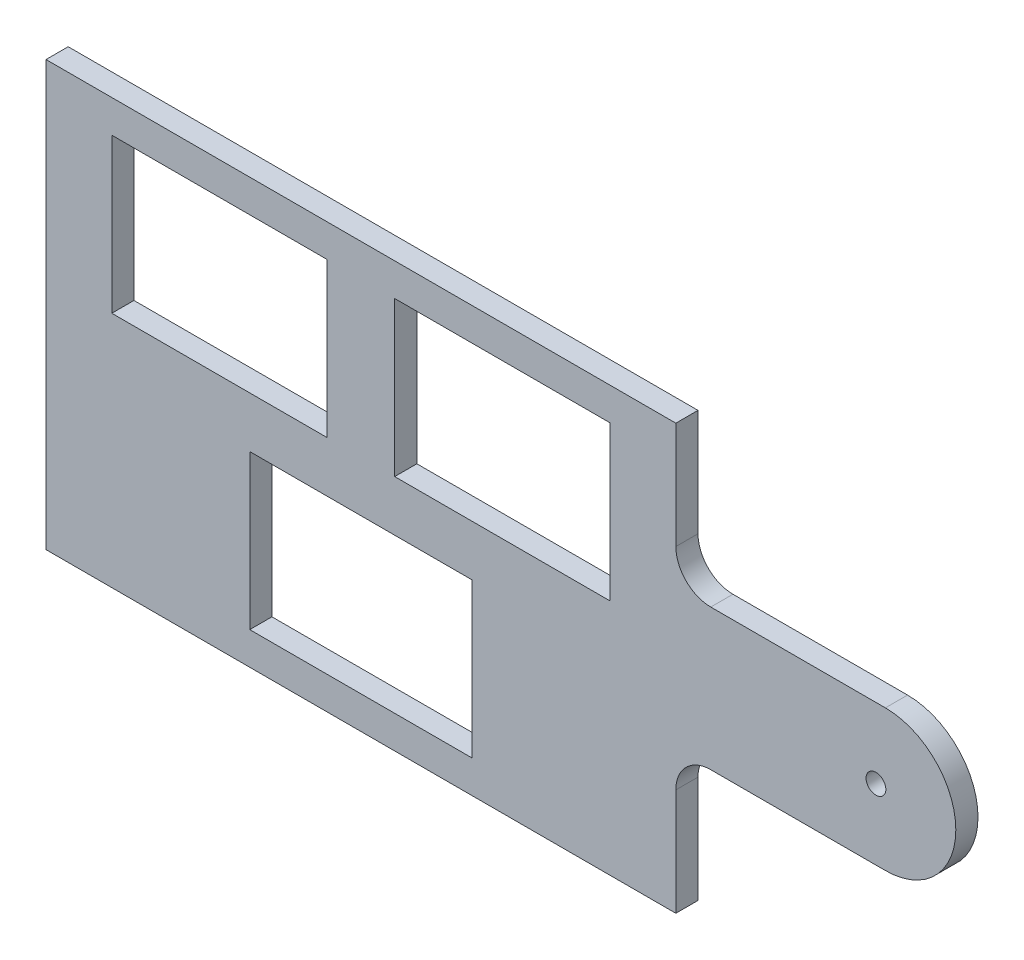
ISO-10303-21;
HEADER;
FILE_DESCRIPTION(('STEP AP214'),'2;1');
FILE_NAME('part.step','',(''),(''),'','','');
FILE_SCHEMA(('AUTOMOTIVE_DESIGN { 1 0 10303 214 1 1 1 1 }'));
ENDSEC;
DATA;
#1=APPLICATION_CONTEXT('core data for automotive mechanical design processes');
#2=APPLICATION_PROTOCOL_DEFINITION('international standard','automotive_design',2000,#1);
#3=PRODUCT_CONTEXT('',#1,'mechanical');
#4=PRODUCT('Part','Part','',(#3));
#5=PRODUCT_RELATED_PRODUCT_CATEGORY('part','',(#4));
#6=PRODUCT_DEFINITION_FORMATION('','',#4);
#7=PRODUCT_DEFINITION_CONTEXT('part definition',#1,'design');
#8=PRODUCT_DEFINITION('design','',#6,#7);
#9=PRODUCT_DEFINITION_SHAPE('','',#8);
#10=(LENGTH_UNIT() NAMED_UNIT(*) SI_UNIT(.MILLI.,.METRE.));
#11=(NAMED_UNIT(*) PLANE_ANGLE_UNIT() SI_UNIT($,.RADIAN.));
#12=(NAMED_UNIT(*) SI_UNIT($,.STERADIAN.) SOLID_ANGLE_UNIT());
#13=UNCERTAINTY_MEASURE_WITH_UNIT(LENGTH_MEASURE(1.E-05),#10,'distance_accuracy_value','');
#14=(GEOMETRIC_REPRESENTATION_CONTEXT(3) GLOBAL_UNCERTAINTY_ASSIGNED_CONTEXT((#13)) GLOBAL_UNIT_ASSIGNED_CONTEXT((#10,
#11,#12)) REPRESENTATION_CONTEXT('',''));
#15=CARTESIAN_POINT('',(0.,0.,0.));
#16=DIRECTION('',(0.,0.,1.));
#17=DIRECTION('',(1.,0.,0.));
#18=AXIS2_PLACEMENT_3D('',#15,#16,#17);
#19=CARTESIAN_POINT('',(45.085,30.385,3.175));
#20=DIRECTION('',(-1.,0.,0.));
#21=DIRECTION('',(0.,-1.,0.));
#22=AXIS2_PLACEMENT_3D('',#19,#20,#21);
#23=PLANE('',#22);
#24=DIRECTION('',(0.,1.,0.));
#25=VECTOR('',#24,1.);
#26=CARTESIAN_POINT('',(45.085,30.385,3.175));
#27=LINE('',#26,#25);
#28=CARTESIAN_POINT('',(45.085,15.085,3.175));
#29=VERTEX_POINT('',#28);
#30=CARTESIAN_POINT('',(45.085,30.385,3.175));
#31=VERTEX_POINT('',#30);
#32=EDGE_CURVE('E321',#29,#31,#27,.T.);
#33=ORIENTED_EDGE('',*,*,#32,.F.);
#34=DIRECTION('',(0.,0.,1.));
#35=VECTOR('',#34,1.);
#36=CARTESIAN_POINT('',(45.085,15.085,3.175));
#37=LINE('',#36,#35);
#38=CARTESIAN_POINT('',(45.085,15.085,0.));
#39=VERTEX_POINT('',#38);
#40=EDGE_CURVE('E58',#29,#39,#37,.F.);
#41=ORIENTED_EDGE('',*,*,#40,.T.);
#42=DIRECTION('',(0.,1.,0.));
#43=VECTOR('',#42,1.);
#44=CARTESIAN_POINT('',(45.085,30.385,0.));
#45=LINE('',#44,#43);
#46=CARTESIAN_POINT('',(45.085,30.385,0.));
#47=VERTEX_POINT('',#46);
#48=EDGE_CURVE('E310',#39,#47,#45,.T.);
#49=ORIENTED_EDGE('',*,*,#48,.T.);
#50=DIRECTION('',(0.,0.,-1.));
#51=VECTOR('',#50,1.);
#52=CARTESIAN_POINT('',(45.085,30.385,3.175));
#53=LINE('',#52,#51);
#54=EDGE_CURVE('E345',#31,#47,#53,.T.);
#55=ORIENTED_EDGE('',*,*,#54,.F.);
#56=EDGE_LOOP('',(#33,#41,#49,#55));
#57=FACE_BOUND('',#56,.T.);
#58=ADVANCED_FACE('F36',(#57),#23,.F.);
#59=CARTESIAN_POINT('',(45.085,-30.385,0.));
#60=VERTEX_POINT('',#59);
#61=CARTESIAN_POINT('',(45.085,-15.085,0.));
#62=VERTEX_POINT('',#61);
#63=EDGE_CURVE('E328',#60,#62,#45,.T.);
#64=ORIENTED_EDGE('',*,*,#63,.T.);
#65=DIRECTION('',(0.,0.,1.));
#66=VECTOR('',#65,1.);
#67=CARTESIAN_POINT('',(45.085,-15.085,3.175));
#68=LINE('',#67,#66);
#69=CARTESIAN_POINT('',(45.085,-15.085,3.175));
#70=VERTEX_POINT('',#69);
#71=EDGE_CURVE('E348',#62,#70,#68,.T.);
#72=ORIENTED_EDGE('',*,*,#71,.T.);
#73=CARTESIAN_POINT('',(45.085,-30.385,3.175));
#74=VERTEX_POINT('',#73);
#75=EDGE_CURVE('E317',#74,#70,#27,.T.);
#76=ORIENTED_EDGE('',*,*,#75,.F.);
#77=DIRECTION('',(0.,0.,-1.));
#78=VECTOR('',#77,1.);
#79=CARTESIAN_POINT('',(45.085,-30.385,3.175));
#80=LINE('',#79,#78);
#81=EDGE_CURVE('E327',#74,#60,#80,.T.);
#82=ORIENTED_EDGE('',*,*,#81,.T.);
#83=EDGE_LOOP('',(#64,#72,#76,#82));
#84=FACE_BOUND('',#83,.T.);
#85=ADVANCED_FACE('F366',(#84),#23,.F.);
#86=CARTESIAN_POINT('',(-45.085,30.385,3.175));
#87=DIRECTION('',(0.,-1.,0.));
#88=DIRECTION('',(0.,0.,-1.));
#89=AXIS2_PLACEMENT_3D('',#86,#87,#88);
#90=PLANE('',#89);
#91=DIRECTION('',(-1.,0.,0.));
#92=VECTOR('',#91,1.);
#93=CARTESIAN_POINT('',(-45.085,30.385,0.));
#94=LINE('',#93,#92);
#95=CARTESIAN_POINT('',(-45.085,30.385,0.));
#96=VERTEX_POINT('',#95);
#97=EDGE_CURVE('E331',#47,#96,#94,.T.);
#98=ORIENTED_EDGE('',*,*,#97,.T.);
#99=DIRECTION('',(0.,0.,-1.));
#100=VECTOR('',#99,1.);
#101=CARTESIAN_POINT('',(-45.085,30.385,3.175));
#102=LINE('',#101,#100);
#103=CARTESIAN_POINT('',(-45.085,30.385,3.175));
#104=VERTEX_POINT('',#103);
#105=EDGE_CURVE('E342',#104,#96,#102,.T.);
#106=ORIENTED_EDGE('',*,*,#105,.F.);
#107=DIRECTION('',(-1.,0.,0.));
#108=VECTOR('',#107,1.);
#109=CARTESIAN_POINT('',(-45.085,30.385,3.175));
#110=LINE('',#109,#108);
#111=EDGE_CURVE('E320',#31,#104,#110,.T.);
#112=ORIENTED_EDGE('',*,*,#111,.F.);
#113=ORIENTED_EDGE('',*,*,#54,.T.);
#114=EDGE_LOOP('',(#98,#106,#112,#113));
#115=FACE_BOUND('',#114,.T.);
#116=ADVANCED_FACE('F389',(#115),#90,.F.);
#117=CARTESIAN_POINT('',(-45.085,30.385,3.175));
#118=DIRECTION('',(1.,0.,0.));
#119=DIRECTION('',(0.,1.,0.));
#120=AXIS2_PLACEMENT_3D('',#117,#118,#119);
#121=PLANE('',#120);
#122=DIRECTION('',(0.,-1.,0.));
#123=VECTOR('',#122,1.);
#124=CARTESIAN_POINT('',(-45.085,30.385,0.));
#125=LINE('',#124,#123);
#126=CARTESIAN_POINT('',(-45.085,-30.385,0.));
#127=VERTEX_POINT('',#126);
#128=EDGE_CURVE('E333',#96,#127,#125,.T.);
#129=ORIENTED_EDGE('',*,*,#128,.T.);
#130=DIRECTION('',(0.,0.,-1.));
#131=VECTOR('',#130,1.);
#132=CARTESIAN_POINT('',(-45.085,-30.385,3.175));
#133=LINE('',#132,#131);
#134=CARTESIAN_POINT('',(-45.085,-30.385,3.175));
#135=VERTEX_POINT('',#134);
#136=EDGE_CURVE('E339',#135,#127,#133,.T.);
#137=ORIENTED_EDGE('',*,*,#136,.F.);
#138=DIRECTION('',(0.,-1.,0.));
#139=VECTOR('',#138,1.);
#140=CARTESIAN_POINT('',(-45.085,30.385,3.175));
#141=LINE('',#140,#139);
#142=EDGE_CURVE('E323',#104,#135,#141,.T.);
#143=ORIENTED_EDGE('',*,*,#142,.F.);
#144=ORIENTED_EDGE('',*,*,#105,.T.);
#145=EDGE_LOOP('',(#129,#137,#143,#144));
#146=FACE_BOUND('',#145,.T.);
#147=ADVANCED_FACE('F441',(#146),#121,.F.);
#148=CARTESIAN_POINT('',(-45.085,-30.385,3.175));
#149=DIRECTION('',(0.,1.,0.));
#150=DIRECTION('',(0.,0.,1.));
#151=AXIS2_PLACEMENT_3D('',#148,#149,#150);
#152=PLANE('',#151);
#153=DIRECTION('',(1.,0.,0.));
#154=VECTOR('',#153,1.);
#155=CARTESIAN_POINT('',(-45.085,-30.385,0.));
#156=LINE('',#155,#154);
#157=EDGE_CURVE('E335',#127,#60,#156,.T.);
#158=ORIENTED_EDGE('',*,*,#157,.T.);
#159=ORIENTED_EDGE('',*,*,#81,.F.);
#160=DIRECTION('',(1.,0.,0.));
#161=VECTOR('',#160,1.);
#162=CARTESIAN_POINT('',(-45.085,-30.385,3.175));
#163=LINE('',#162,#161);
#164=EDGE_CURVE('E325',#135,#74,#163,.T.);
#165=ORIENTED_EDGE('',*,*,#164,.F.);
#166=ORIENTED_EDGE('',*,*,#136,.T.);
#167=EDGE_LOOP('',(#158,#159,#165,#166));
#168=FACE_BOUND('',#167,.T.);
#169=ADVANCED_FACE('F435',(#168),#152,.F.);
#170=CARTESIAN_POINT('',(0.,0.,3.175));
#171=DIRECTION('',(0.,0.,1.));
#172=DIRECTION('',(1.,0.,0.));
#173=AXIS2_PLACEMENT_3D('',#170,#171,#172);
#174=PLANE('',#173);
#175=CARTESIAN_POINT('',(73.735,0.,3.175));
#176=DIRECTION('',(0.,0.,1.));
#177=DIRECTION('',(1.,0.,0.));
#178=AXIS2_PLACEMENT_3D('',#175,#176,#177);
#179=CIRCLE('',#178,1.415);
#180=CARTESIAN_POINT('',(75.15,0.,3.175));
#181=VERTEX_POINT('',#180);
#182=EDGE_CURVE('E213',#181,#181,#179,.T.);
#183=ORIENTED_EDGE('',*,*,#182,.F.);
#184=EDGE_LOOP('',(#183));
#185=FACE_BOUND('',#184,.T.);
#186=DIRECTION('',(0.,1.,0.));
#187=VECTOR('',#186,1.);
#188=CARTESIAN_POINT('',(15.915,-3.635,3.175));
#189=LINE('',#188,#187);
#190=CARTESIAN_POINT('',(15.915,-25.715,3.175));
#191=VERTEX_POINT('',#190);
#192=CARTESIAN_POINT('',(15.915,-3.635,3.175));
#193=VERTEX_POINT('',#192);
#194=EDGE_CURVE('E219',#191,#193,#189,.T.);
#195=ORIENTED_EDGE('',*,*,#194,.F.);
#196=DIRECTION('',(1.,0.,0.));
#197=VECTOR('',#196,1.);
#198=CARTESIAN_POINT('',(-15.915,-25.715,3.175));
#199=LINE('',#198,#197);
#200=CARTESIAN_POINT('',(-15.915,-25.715,3.175));
#201=VERTEX_POINT('',#200);
#202=EDGE_CURVE('E259',#201,#191,#199,.T.);
#203=ORIENTED_EDGE('',*,*,#202,.F.);
#204=DIRECTION('',(0.,-1.,0.));
#205=VECTOR('',#204,1.);
#206=CARTESIAN_POINT('',(-15.915,-3.635,3.175));
#207=LINE('',#206,#205);
#208=CARTESIAN_POINT('',(-15.915,-3.635,3.175));
#209=VERTEX_POINT('',#208);
#210=EDGE_CURVE('E273',#209,#201,#207,.T.);
#211=ORIENTED_EDGE('',*,*,#210,.F.);
#212=DIRECTION('',(-1.,0.,0.));
#213=VECTOR('',#212,1.);
#214=CARTESIAN_POINT('',(15.915,-3.635,3.175));
#215=LINE('',#214,#213);
#216=EDGE_CURVE('E270',#193,#209,#215,.T.);
#217=ORIENTED_EDGE('',*,*,#216,.F.);
#218=EDGE_LOOP('',(#195,#203,#211,#217));
#219=FACE_BOUND('',#218,.T.);
#220=DIRECTION('',(-1.,0.,0.));
#221=VECTOR('',#220,1.);
#222=CARTESIAN_POINT('',(-35.665,25.715,3.175));
#223=LINE('',#222,#221);
#224=CARTESIAN_POINT('',(-4.83500000000001,25.715,3.175));
#225=VERTEX_POINT('',#224);
#226=CARTESIAN_POINT('',(-35.665,25.715,3.175));
#227=VERTEX_POINT('',#226);
#228=EDGE_CURVE('E235',#225,#227,#223,.T.);
#229=ORIENTED_EDGE('',*,*,#228,.F.);
#230=DIRECTION('',(0.,1.,0.));
#231=VECTOR('',#230,1.);
#232=CARTESIAN_POINT('',(-4.83500000000001,25.715,3.175));
#233=LINE('',#232,#231);
#234=CARTESIAN_POINT('',(-4.83500000000001,3.63499999999999,3.175));
#235=VERTEX_POINT('',#234);
#236=EDGE_CURVE('E225',#235,#225,#233,.T.);
#237=ORIENTED_EDGE('',*,*,#236,.F.);
#238=DIRECTION('',(1.,0.,0.));
#239=VECTOR('',#238,1.);
#240=CARTESIAN_POINT('',(-35.665,3.63499999999999,3.175));
#241=LINE('',#240,#239);
#242=CARTESIAN_POINT('',(-35.665,3.63499999999999,3.175));
#243=VERTEX_POINT('',#242);
#244=EDGE_CURVE('E241',#243,#235,#241,.T.);
#245=ORIENTED_EDGE('',*,*,#244,.F.);
#246=DIRECTION('',(0.,-1.,0.));
#247=VECTOR('',#246,1.);
#248=CARTESIAN_POINT('',(-35.665,25.715,3.175));
#249=LINE('',#248,#247);
#250=EDGE_CURVE('E237',#227,#243,#249,.T.);
#251=ORIENTED_EDGE('',*,*,#250,.F.);
#252=EDGE_LOOP('',(#229,#237,#245,#251));
#253=FACE_BOUND('',#252,.T.);
#254=DIRECTION('',(0.,1.,0.));
#255=VECTOR('',#254,1.);
#256=CARTESIAN_POINT('',(35.665,25.715,3.175));
#257=LINE('',#256,#255);
#258=CARTESIAN_POINT('',(35.665,3.63499999999999,3.175));
#259=VERTEX_POINT('',#258);
#260=CARTESIAN_POINT('',(35.665,25.715,3.175));
#261=VERTEX_POINT('',#260);
#262=EDGE_CURVE('E248',#259,#261,#257,.T.);
#263=ORIENTED_EDGE('',*,*,#262,.F.);
#264=DIRECTION('',(1.,0.,0.));
#265=VECTOR('',#264,1.);
#266=CARTESIAN_POINT('',(35.665,3.63499999999999,3.175));
#267=LINE('',#266,#265);
#268=CARTESIAN_POINT('',(4.83500000000001,3.63499999999999,3.175));
#269=VERTEX_POINT('',#268);
#270=EDGE_CURVE('E289',#269,#259,#267,.T.);
#271=ORIENTED_EDGE('',*,*,#270,.F.);
#272=DIRECTION('',(0.,-1.,0.));
#273=VECTOR('',#272,1.);
#274=CARTESIAN_POINT('',(4.83500000000001,25.715,3.175));
#275=LINE('',#274,#273);
#276=CARTESIAN_POINT('',(4.83500000000001,25.715,3.175));
#277=VERTEX_POINT('',#276);
#278=EDGE_CURVE('E303',#277,#269,#275,.T.);
#279=ORIENTED_EDGE('',*,*,#278,.F.);
#280=DIRECTION('',(-1.,0.,0.));
#281=VECTOR('',#280,1.);
#282=CARTESIAN_POINT('',(35.665,25.715,3.175));
#283=LINE('',#282,#281);
#284=EDGE_CURVE('E300',#261,#277,#283,.T.);
#285=ORIENTED_EDGE('',*,*,#284,.F.);
#286=EDGE_LOOP('',(#263,#271,#279,#285));
#287=FACE_BOUND('',#286,.T.);
#288=ORIENTED_EDGE('',*,*,#75,.T.);
#289=CARTESIAN_POINT('',(50.085,-15.085,3.175));
#290=DIRECTION('',(0.,0.,1.));
#291=DIRECTION('',(1.,0.,0.));
#292=AXIS2_PLACEMENT_3D('',#289,#290,#291);
#293=CIRCLE('',#292,5.);
#294=CARTESIAN_POINT('',(50.085,-10.085,3.175));
#295=VERTEX_POINT('',#294);
#296=EDGE_CURVE('E356',#70,#295,#293,.F.);
#297=ORIENTED_EDGE('',*,*,#296,.T.);
#298=DIRECTION('',(1.,0.,0.));
#299=VECTOR('',#298,1.);
#300=CARTESIAN_POINT('',(45.085,-10.085,3.175));
#301=LINE('',#300,#299);
#302=CARTESIAN_POINT('',(75.085,-10.085,3.175));
#303=VERTEX_POINT('',#302);
#304=EDGE_CURVE('E209',#295,#303,#301,.T.);
#305=ORIENTED_EDGE('',*,*,#304,.T.);
#306=CARTESIAN_POINT('',(75.085,0.,3.175));
#307=DIRECTION('',(0.,0.,1.));
#308=DIRECTION('',(-1.,0.,0.));
#309=AXIS2_PLACEMENT_3D('',#306,#307,#308);
#310=CIRCLE('',#309,10.085);
#311=CARTESIAN_POINT('',(75.085,10.085,3.175));
#312=VERTEX_POINT('',#311);
#313=EDGE_CURVE('E216',#303,#312,#310,.T.);
#314=ORIENTED_EDGE('',*,*,#313,.T.);
#315=DIRECTION('',(-1.,0.,0.));
#316=VECTOR('',#315,1.);
#317=CARTESIAN_POINT('',(45.085,10.085,3.175));
#318=LINE('',#317,#316);
#319=CARTESIAN_POINT('',(50.085,10.085,3.175));
#320=VERTEX_POINT('',#319);
#321=EDGE_CURVE('E190',#312,#320,#318,.T.);
#322=ORIENTED_EDGE('',*,*,#321,.T.);
#323=CARTESIAN_POINT('',(50.085,15.085,3.175));
#324=DIRECTION('',(0.,0.,1.));
#325=DIRECTION('',(1.,0.,0.));
#326=AXIS2_PLACEMENT_3D('',#323,#324,#325);
#327=CIRCLE('',#326,5.);
#328=EDGE_CURVE('E45',#320,#29,#327,.F.);
#329=ORIENTED_EDGE('',*,*,#328,.T.);
#330=ORIENTED_EDGE('',*,*,#32,.T.);
#331=ORIENTED_EDGE('',*,*,#111,.T.);
#332=ORIENTED_EDGE('',*,*,#142,.T.);
#333=ORIENTED_EDGE('',*,*,#164,.T.);
#334=EDGE_LOOP('',(#288,#297,#305,#314,#322,#329,#330,#331,#332,#333));
#335=FACE_BOUND('',#334,.T.);
#336=ADVANCED_FACE('F371',(#185,#219,#253,#287,#335),#174,.T.);
#337=CARTESIAN_POINT('',(0.,0.,0.));
#338=DIRECTION('',(0.,0.,1.));
#339=DIRECTION('',(1.,0.,0.));
#340=AXIS2_PLACEMENT_3D('',#337,#338,#339);
#341=PLANE('',#340);
#342=CARTESIAN_POINT('',(73.735,0.,0.));
#343=DIRECTION('',(0.,0.,1.));
#344=DIRECTION('',(1.,0.,0.));
#345=AXIS2_PLACEMENT_3D('',#342,#343,#344);
#346=CIRCLE('',#345,1.415);
#347=CARTESIAN_POINT('',(75.15,0.,0.));
#348=VERTEX_POINT('',#347);
#349=EDGE_CURVE('E40',#348,#348,#346,.T.);
#350=ORIENTED_EDGE('',*,*,#349,.T.);
#351=EDGE_LOOP('',(#350));
#352=FACE_BOUND('',#351,.T.);
#353=DIRECTION('',(1.,0.,0.));
#354=VECTOR('',#353,1.);
#355=CARTESIAN_POINT('',(-15.915,-25.715,0.));
#356=LINE('',#355,#354);
#357=CARTESIAN_POINT('',(-15.915,-25.715,0.));
#358=VERTEX_POINT('',#357);
#359=CARTESIAN_POINT('',(15.915,-25.715,0.));
#360=VERTEX_POINT('',#359);
#361=EDGE_CURVE('E265',#358,#360,#356,.T.);
#362=ORIENTED_EDGE('',*,*,#361,.T.);
#363=DIRECTION('',(0.,1.,0.));
#364=VECTOR('',#363,1.);
#365=CARTESIAN_POINT('',(15.915,-3.635,0.));
#366=LINE('',#365,#364);
#367=CARTESIAN_POINT('',(15.915,-3.635,0.));
#368=VERTEX_POINT('',#367);
#369=EDGE_CURVE('E255',#360,#368,#366,.T.);
#370=ORIENTED_EDGE('',*,*,#369,.T.);
#371=DIRECTION('',(-1.,0.,0.));
#372=VECTOR('',#371,1.);
#373=CARTESIAN_POINT('',(15.915,-3.635,0.));
#374=LINE('',#373,#372);
#375=CARTESIAN_POINT('',(-15.915,-3.635,0.));
#376=VERTEX_POINT('',#375);
#377=EDGE_CURVE('E258',#368,#376,#374,.T.);
#378=ORIENTED_EDGE('',*,*,#377,.T.);
#379=DIRECTION('',(0.,-1.,0.));
#380=VECTOR('',#379,1.);
#381=CARTESIAN_POINT('',(-15.915,-3.635,0.));
#382=LINE('',#381,#380);
#383=EDGE_CURVE('E262',#376,#358,#382,.T.);
#384=ORIENTED_EDGE('',*,*,#383,.T.);
#385=EDGE_LOOP('',(#362,#370,#378,#384));
#386=FACE_BOUND('',#385,.T.);
#387=DIRECTION('',(0.,1.,0.));
#388=VECTOR('',#387,1.);
#389=CARTESIAN_POINT('',(-4.83500000000001,25.715,0.));
#390=LINE('',#389,#388);
#391=CARTESIAN_POINT('',(-4.83500000000001,3.63499999999999,0.));
#392=VERTEX_POINT('',#391);
#393=CARTESIAN_POINT('',(-4.83500000000001,25.715,0.));
#394=VERTEX_POINT('',#393);
#395=EDGE_CURVE('E231',#392,#394,#390,.T.);
#396=ORIENTED_EDGE('',*,*,#395,.T.);
#397=DIRECTION('',(-1.,0.,0.));
#398=VECTOR('',#397,1.);
#399=CARTESIAN_POINT('',(-35.665,25.715,0.));
#400=LINE('',#399,#398);
#401=CARTESIAN_POINT('',(-35.665,25.715,0.));
#402=VERTEX_POINT('',#401);
#403=EDGE_CURVE('E221',#394,#402,#400,.T.);
#404=ORIENTED_EDGE('',*,*,#403,.T.);
#405=DIRECTION('',(0.,-1.,0.));
#406=VECTOR('',#405,1.);
#407=CARTESIAN_POINT('',(-35.665,25.715,0.));
#408=LINE('',#407,#406);
#409=CARTESIAN_POINT('',(-35.665,3.63499999999999,0.));
#410=VERTEX_POINT('',#409);
#411=EDGE_CURVE('E224',#402,#410,#408,.T.);
#412=ORIENTED_EDGE('',*,*,#411,.T.);
#413=DIRECTION('',(1.,0.,0.));
#414=VECTOR('',#413,1.);
#415=CARTESIAN_POINT('',(-35.665,3.63499999999999,0.));
#416=LINE('',#415,#414);
#417=EDGE_CURVE('E228',#410,#392,#416,.T.);
#418=ORIENTED_EDGE('',*,*,#417,.T.);
#419=EDGE_LOOP('',(#396,#404,#412,#418));
#420=FACE_BOUND('',#419,.T.);
#421=DIRECTION('',(1.,0.,0.));
#422=VECTOR('',#421,1.);
#423=CARTESIAN_POINT('',(35.665,3.63499999999999,0.));
#424=LINE('',#423,#422);
#425=CARTESIAN_POINT('',(4.83500000000001,3.63499999999999,0.));
#426=VERTEX_POINT('',#425);
#427=CARTESIAN_POINT('',(35.665,3.63499999999999,0.));
#428=VERTEX_POINT('',#427);
#429=EDGE_CURVE('E295',#426,#428,#424,.T.);
#430=ORIENTED_EDGE('',*,*,#429,.T.);
#431=DIRECTION('',(0.,1.,0.));
#432=VECTOR('',#431,1.);
#433=CARTESIAN_POINT('',(35.665,25.715,0.));
#434=LINE('',#433,#432);
#435=CARTESIAN_POINT('',(35.665,25.715,0.));
#436=VERTEX_POINT('',#435);
#437=EDGE_CURVE('E285',#428,#436,#434,.T.);
#438=ORIENTED_EDGE('',*,*,#437,.T.);
#439=DIRECTION('',(-1.,0.,0.));
#440=VECTOR('',#439,1.);
#441=CARTESIAN_POINT('',(35.665,25.715,0.));
#442=LINE('',#441,#440);
#443=CARTESIAN_POINT('',(4.83500000000001,25.715,0.));
#444=VERTEX_POINT('',#443);
#445=EDGE_CURVE('E288',#436,#444,#442,.T.);
#446=ORIENTED_EDGE('',*,*,#445,.T.);
#447=DIRECTION('',(0.,-1.,0.));
#448=VECTOR('',#447,1.);
#449=CARTESIAN_POINT('',(4.83500000000001,25.715,0.));
#450=LINE('',#449,#448);
#451=EDGE_CURVE('E292',#444,#426,#450,.T.);
#452=ORIENTED_EDGE('',*,*,#451,.T.);
#453=EDGE_LOOP('',(#430,#438,#446,#452));
#454=FACE_BOUND('',#453,.T.);
#455=ORIENTED_EDGE('',*,*,#63,.F.);
#456=ORIENTED_EDGE('',*,*,#157,.F.);
#457=ORIENTED_EDGE('',*,*,#128,.F.);
#458=ORIENTED_EDGE('',*,*,#97,.F.);
#459=ORIENTED_EDGE('',*,*,#48,.F.);
#460=CARTESIAN_POINT('',(50.085,15.085,0.));
#461=DIRECTION('',(0.,0.,1.));
#462=DIRECTION('',(1.,0.,0.));
#463=AXIS2_PLACEMENT_3D('',#460,#461,#462);
#464=CIRCLE('',#463,5.);
#465=CARTESIAN_POINT('',(50.085,10.085,0.));
#466=VERTEX_POINT('',#465);
#467=EDGE_CURVE('E11',#39,#466,#464,.T.);
#468=ORIENTED_EDGE('',*,*,#467,.T.);
#469=DIRECTION('',(-1.,0.,0.));
#470=VECTOR('',#469,1.);
#471=CARTESIAN_POINT('',(45.085,10.085,0.));
#472=LINE('',#471,#470);
#473=CARTESIAN_POINT('',(75.085,10.085,0.));
#474=VERTEX_POINT('',#473);
#475=EDGE_CURVE('E188',#474,#466,#472,.T.);
#476=ORIENTED_EDGE('',*,*,#475,.F.);
#477=CARTESIAN_POINT('',(75.085,0.,0.));
#478=DIRECTION('',(0.,0.,1.));
#479=DIRECTION('',(-1.,0.,0.));
#480=AXIS2_PLACEMENT_3D('',#477,#478,#479);
#481=CIRCLE('',#480,10.085);
#482=CARTESIAN_POINT('',(75.085,-10.085,0.));
#483=VERTEX_POINT('',#482);
#484=EDGE_CURVE('E203',#483,#474,#481,.T.);
#485=ORIENTED_EDGE('',*,*,#484,.F.);
#486=DIRECTION('',(1.,0.,0.));
#487=VECTOR('',#486,1.);
#488=CARTESIAN_POINT('',(45.085,-10.085,0.));
#489=LINE('',#488,#487);
#490=CARTESIAN_POINT('',(50.085,-10.085,0.));
#491=VERTEX_POINT('',#490);
#492=EDGE_CURVE('E196',#491,#483,#489,.T.);
#493=ORIENTED_EDGE('',*,*,#492,.F.);
#494=CARTESIAN_POINT('',(50.085,-15.085,0.));
#495=DIRECTION('',(0.,0.,1.));
#496=DIRECTION('',(1.,0.,0.));
#497=AXIS2_PLACEMENT_3D('',#494,#495,#496);
#498=CIRCLE('',#497,5.);
#499=EDGE_CURVE('E358',#491,#62,#498,.T.);
#500=ORIENTED_EDGE('',*,*,#499,.T.);
#501=EDGE_LOOP('',(#455,#456,#457,#458,#459,#468,#476,#485,#493,#500));
#502=FACE_BOUND('',#501,.T.);
#503=ADVANCED_FACE('F201',(#352,#386,#420,#454,#502),#341,.F.);
#504=CARTESIAN_POINT('',(35.665,25.715,0.));
#505=DIRECTION('',(1.,0.,0.));
#506=DIRECTION('',(0.,0.,-1.));
#507=AXIS2_PLACEMENT_3D('',#504,#505,#506);
#508=PLANE('',#507);
#509=ORIENTED_EDGE('',*,*,#262,.T.);
#510=DIRECTION('',(0.,0.,1.));
#511=VECTOR('',#510,1.);
#512=CARTESIAN_POINT('',(35.665,25.715,0.));
#513=LINE('',#512,#511);
#514=EDGE_CURVE('E298',#436,#261,#513,.T.);
#515=ORIENTED_EDGE('',*,*,#514,.F.);
#516=ORIENTED_EDGE('',*,*,#437,.F.);
#517=DIRECTION('',(0.,0.,1.));
#518=VECTOR('',#517,1.);
#519=CARTESIAN_POINT('',(35.665,3.63499999999999,0.));
#520=LINE('',#519,#518);
#521=EDGE_CURVE('E308',#428,#259,#520,.T.);
#522=ORIENTED_EDGE('',*,*,#521,.T.);
#523=EDGE_LOOP('',(#509,#515,#516,#522));
#524=FACE_BOUND('',#523,.T.);
#525=ADVANCED_FACE('F412',(#524),#508,.F.);
#526=CARTESIAN_POINT('',(35.665,3.63499999999999,0.));
#527=DIRECTION('',(0.,-1.,0.));
#528=DIRECTION('',(1.,0.,0.));
#529=AXIS2_PLACEMENT_3D('',#526,#527,#528);
#530=PLANE('',#529);
#531=ORIENTED_EDGE('',*,*,#270,.T.);
#532=ORIENTED_EDGE('',*,*,#521,.F.);
#533=ORIENTED_EDGE('',*,*,#429,.F.);
#534=DIRECTION('',(0.,0.,1.));
#535=VECTOR('',#534,1.);
#536=CARTESIAN_POINT('',(4.83500000000001,3.63499999999999,0.));
#537=LINE('',#536,#535);
#538=EDGE_CURVE('E311',#426,#269,#537,.T.);
#539=ORIENTED_EDGE('',*,*,#538,.T.);
#540=EDGE_LOOP('',(#531,#532,#533,#539));
#541=FACE_BOUND('',#540,.T.);
#542=ADVANCED_FACE('F421',(#541),#530,.F.);
#543=CARTESIAN_POINT('',(4.83500000000001,25.715,0.));
#544=DIRECTION('',(-1.,0.,0.));
#545=DIRECTION('',(0.,-1.,0.));
#546=AXIS2_PLACEMENT_3D('',#543,#544,#545);
#547=PLANE('',#546);
#548=ORIENTED_EDGE('',*,*,#278,.T.);
#549=ORIENTED_EDGE('',*,*,#538,.F.);
#550=ORIENTED_EDGE('',*,*,#451,.F.);
#551=DIRECTION('',(0.,0.,1.));
#552=VECTOR('',#551,1.);
#553=CARTESIAN_POINT('',(4.83500000000001,25.715,0.));
#554=LINE('',#553,#552);
#555=EDGE_CURVE('E313',#444,#277,#554,.T.);
#556=ORIENTED_EDGE('',*,*,#555,.T.);
#557=EDGE_LOOP('',(#548,#549,#550,#556));
#558=FACE_BOUND('',#557,.T.);
#559=ADVANCED_FACE('F432',(#558),#547,.F.);
#560=CARTESIAN_POINT('',(35.665,25.715,0.));
#561=DIRECTION('',(0.,1.,0.));
#562=DIRECTION('',(0.,0.,1.));
#563=AXIS2_PLACEMENT_3D('',#560,#561,#562);
#564=PLANE('',#563);
#565=ORIENTED_EDGE('',*,*,#284,.T.);
#566=ORIENTED_EDGE('',*,*,#555,.F.);
#567=ORIENTED_EDGE('',*,*,#445,.F.);
#568=ORIENTED_EDGE('',*,*,#514,.T.);
#569=EDGE_LOOP('',(#565,#566,#567,#568));
#570=FACE_BOUND('',#569,.T.);
#571=ADVANCED_FACE('F429',(#570),#564,.F.);
#572=CARTESIAN_POINT('',(-35.665,25.715,0.));
#573=DIRECTION('',(0.,1.,0.));
#574=DIRECTION('',(0.,0.,1.));
#575=AXIS2_PLACEMENT_3D('',#572,#573,#574);
#576=PLANE('',#575);
#577=ORIENTED_EDGE('',*,*,#228,.T.);
#578=DIRECTION('',(0.,0.,1.));
#579=VECTOR('',#578,1.);
#580=CARTESIAN_POINT('',(-35.665,25.715,0.));
#581=LINE('',#580,#579);
#582=EDGE_CURVE('E234',#402,#227,#581,.T.);
#583=ORIENTED_EDGE('',*,*,#582,.F.);
#584=ORIENTED_EDGE('',*,*,#403,.F.);
#585=DIRECTION('',(0.,0.,1.));
#586=VECTOR('',#585,1.);
#587=CARTESIAN_POINT('',(-4.83500000000001,25.715,0.));
#588=LINE('',#587,#586);
#589=EDGE_CURVE('E246',#394,#225,#588,.T.);
#590=ORIENTED_EDGE('',*,*,#589,.T.);
#591=EDGE_LOOP('',(#577,#583,#584,#590));
#592=FACE_BOUND('',#591,.T.);
#593=ADVANCED_FACE('F531',(#592),#576,.F.);
#594=CARTESIAN_POINT('',(-4.83500000000001,25.715,0.));
#595=DIRECTION('',(1.,0.,0.));
#596=DIRECTION('',(0.,1.,0.));
#597=AXIS2_PLACEMENT_3D('',#594,#595,#596);
#598=PLANE('',#597);
#599=ORIENTED_EDGE('',*,*,#236,.T.);
#600=ORIENTED_EDGE('',*,*,#589,.F.);
#601=ORIENTED_EDGE('',*,*,#395,.F.);
#602=DIRECTION('',(0.,0.,1.));
#603=VECTOR('',#602,1.);
#604=CARTESIAN_POINT('',(-4.83500000000001,3.63499999999999,0.));
#605=LINE('',#604,#603);
#606=EDGE_CURVE('E249',#392,#235,#605,.T.);
#607=ORIENTED_EDGE('',*,*,#606,.T.);
#608=EDGE_LOOP('',(#599,#600,#601,#607));
#609=FACE_BOUND('',#608,.T.);
#610=ADVANCED_FACE('F537',(#609),#598,.F.);
#611=CARTESIAN_POINT('',(-35.665,3.63499999999999,0.));
#612=DIRECTION('',(0.,-1.,0.));
#613=DIRECTION('',(1.,0.,0.));
#614=AXIS2_PLACEMENT_3D('',#611,#612,#613);
#615=PLANE('',#614);
#616=ORIENTED_EDGE('',*,*,#244,.T.);
#617=ORIENTED_EDGE('',*,*,#606,.F.);
#618=ORIENTED_EDGE('',*,*,#417,.F.);
#619=DIRECTION('',(0.,0.,1.));
#620=VECTOR('',#619,1.);
#621=CARTESIAN_POINT('',(-35.665,3.63499999999999,0.));
#622=LINE('',#621,#620);
#623=EDGE_CURVE('E251',#410,#243,#622,.T.);
#624=ORIENTED_EDGE('',*,*,#623,.T.);
#625=EDGE_LOOP('',(#616,#617,#618,#624));
#626=FACE_BOUND('',#625,.T.);
#627=ADVANCED_FACE('F545',(#626),#615,.F.);
#628=CARTESIAN_POINT('',(-35.665,25.715,0.));
#629=DIRECTION('',(-1.,0.,0.));
#630=DIRECTION('',(0.,0.,1.));
#631=AXIS2_PLACEMENT_3D('',#628,#629,#630);
#632=PLANE('',#631);
#633=ORIENTED_EDGE('',*,*,#250,.T.);
#634=ORIENTED_EDGE('',*,*,#623,.F.);
#635=ORIENTED_EDGE('',*,*,#411,.F.);
#636=ORIENTED_EDGE('',*,*,#582,.T.);
#637=EDGE_LOOP('',(#633,#634,#635,#636));
#638=FACE_BOUND('',#637,.T.);
#639=ADVANCED_FACE('F553',(#638),#632,.F.);
#640=CARTESIAN_POINT('',(15.915,-3.635,0.));
#641=DIRECTION('',(1.,0.,0.));
#642=DIRECTION('',(0.,1.,0.));
#643=AXIS2_PLACEMENT_3D('',#640,#641,#642);
#644=PLANE('',#643);
#645=ORIENTED_EDGE('',*,*,#194,.T.);
#646=DIRECTION('',(0.,0.,1.));
#647=VECTOR('',#646,1.);
#648=CARTESIAN_POINT('',(15.915,-3.635,0.));
#649=LINE('',#648,#647);
#650=EDGE_CURVE('E268',#368,#193,#649,.T.);
#651=ORIENTED_EDGE('',*,*,#650,.F.);
#652=ORIENTED_EDGE('',*,*,#369,.F.);
#653=DIRECTION('',(0.,0.,1.));
#654=VECTOR('',#653,1.);
#655=CARTESIAN_POINT('',(15.915,-25.715,0.));
#656=LINE('',#655,#654);
#657=EDGE_CURVE('E238',#360,#191,#656,.T.);
#658=ORIENTED_EDGE('',*,*,#657,.T.);
#659=EDGE_LOOP('',(#645,#651,#652,#658));
#660=FACE_BOUND('',#659,.T.);
#661=ADVANCED_FACE('F561',(#660),#644,.F.);
#662=CARTESIAN_POINT('',(-15.915,-25.715,0.));
#663=DIRECTION('',(0.,-1.,0.));
#664=DIRECTION('',(0.,0.,-1.));
#665=AXIS2_PLACEMENT_3D('',#662,#663,#664);
#666=PLANE('',#665);
#667=ORIENTED_EDGE('',*,*,#202,.T.);
#668=ORIENTED_EDGE('',*,*,#657,.F.);
#669=ORIENTED_EDGE('',*,*,#361,.F.);
#670=DIRECTION('',(0.,0.,1.));
#671=VECTOR('',#670,1.);
#672=CARTESIAN_POINT('',(-15.915,-25.715,0.));
#673=LINE('',#672,#671);
#674=EDGE_CURVE('E279',#358,#201,#673,.T.);
#675=ORIENTED_EDGE('',*,*,#674,.T.);
#676=EDGE_LOOP('',(#667,#668,#669,#675));
#677=FACE_BOUND('',#676,.T.);
#678=ADVANCED_FACE('F569',(#677),#666,.F.);
#679=CARTESIAN_POINT('',(-15.915,-3.635,0.));
#680=DIRECTION('',(-1.,0.,0.));
#681=DIRECTION('',(0.,-1.,0.));
#682=AXIS2_PLACEMENT_3D('',#679,#680,#681);
#683=PLANE('',#682);
#684=ORIENTED_EDGE('',*,*,#210,.T.);
#685=ORIENTED_EDGE('',*,*,#674,.F.);
#686=ORIENTED_EDGE('',*,*,#383,.F.);
#687=DIRECTION('',(0.,0.,1.));
#688=VECTOR('',#687,1.);
#689=CARTESIAN_POINT('',(-15.915,-3.635,0.));
#690=LINE('',#689,#688);
#691=EDGE_CURVE('E281',#376,#209,#690,.T.);
#692=ORIENTED_EDGE('',*,*,#691,.T.);
#693=EDGE_LOOP('',(#684,#685,#686,#692));
#694=FACE_BOUND('',#693,.T.);
#695=ADVANCED_FACE('F577',(#694),#683,.F.);
#696=CARTESIAN_POINT('',(15.915,-3.635,0.));
#697=DIRECTION('',(0.,1.,0.));
#698=DIRECTION('',(0.,0.,1.));
#699=AXIS2_PLACEMENT_3D('',#696,#697,#698);
#700=PLANE('',#699);
#701=ORIENTED_EDGE('',*,*,#216,.T.);
#702=ORIENTED_EDGE('',*,*,#691,.F.);
#703=ORIENTED_EDGE('',*,*,#377,.F.);
#704=ORIENTED_EDGE('',*,*,#650,.T.);
#705=EDGE_LOOP('',(#701,#702,#703,#704));
#706=FACE_BOUND('',#705,.T.);
#707=ADVANCED_FACE('F381',(#706),#700,.F.);
#708=CARTESIAN_POINT('',(75.085,0.,0.));
#709=DIRECTION('',(0.,0.,1.));
#710=DIRECTION('',(1.,0.,0.));
#711=AXIS2_PLACEMENT_3D('',#708,#709,#710);
#712=CYLINDRICAL_SURFACE('',#711,10.085);
#713=ORIENTED_EDGE('',*,*,#313,.F.);
#714=DIRECTION('',(0.,0.,1.));
#715=VECTOR('',#714,1.);
#716=CARTESIAN_POINT('',(75.085,-10.085,0.));
#717=LINE('',#716,#715);
#718=EDGE_CURVE('E195',#483,#303,#717,.T.);
#719=ORIENTED_EDGE('',*,*,#718,.F.);
#720=ORIENTED_EDGE('',*,*,#484,.T.);
#721=DIRECTION('',(0.,0.,1.));
#722=VECTOR('',#721,1.);
#723=CARTESIAN_POINT('',(75.085,10.085,0.));
#724=LINE('',#723,#722);
#725=EDGE_CURVE('E184',#474,#312,#724,.T.);
#726=ORIENTED_EDGE('',*,*,#725,.T.);
#727=EDGE_LOOP('',(#713,#719,#720,#726));
#728=FACE_BOUND('',#727,.T.);
#729=ADVANCED_FACE('F207',(#728),#712,.T.);
#730=CARTESIAN_POINT('',(45.085,-10.085,0.));
#731=DIRECTION('',(0.,-1.,0.));
#732=DIRECTION('',(1.,0.,0.));
#733=AXIS2_PLACEMENT_3D('',#730,#731,#732);
#734=PLANE('',#733);
#735=ORIENTED_EDGE('',*,*,#304,.F.);
#736=DIRECTION('',(0.,0.,1.));
#737=VECTOR('',#736,1.);
#738=CARTESIAN_POINT('',(50.085,-10.085,0.));
#739=LINE('',#738,#737);
#740=EDGE_CURVE('E351',#295,#491,#739,.F.);
#741=ORIENTED_EDGE('',*,*,#740,.T.);
#742=ORIENTED_EDGE('',*,*,#492,.T.);
#743=ORIENTED_EDGE('',*,*,#718,.T.);
#744=EDGE_LOOP('',(#735,#741,#742,#743));
#745=FACE_BOUND('',#744,.T.);
#746=ADVANCED_FACE('F373',(#745),#734,.T.);
#747=CARTESIAN_POINT('',(45.085,10.085,0.));
#748=DIRECTION('',(0.,1.,0.));
#749=DIRECTION('',(0.,0.,1.));
#750=AXIS2_PLACEMENT_3D('',#747,#748,#749);
#751=PLANE('',#750);
#752=ORIENTED_EDGE('',*,*,#475,.T.);
#753=DIRECTION('',(0.,0.,1.));
#754=VECTOR('',#753,1.);
#755=CARTESIAN_POINT('',(50.085,10.085,0.));
#756=LINE('',#755,#754);
#757=EDGE_CURVE('E353',#466,#320,#756,.T.);
#758=ORIENTED_EDGE('',*,*,#757,.T.);
#759=ORIENTED_EDGE('',*,*,#321,.F.);
#760=ORIENTED_EDGE('',*,*,#725,.F.);
#761=EDGE_LOOP('',(#752,#758,#759,#760));
#762=FACE_BOUND('',#761,.T.);
#763=ADVANCED_FACE('F186',(#762),#751,.T.);
#764=CARTESIAN_POINT('',(50.085,-15.085,3.175));
#765=DIRECTION('',(0.,0.,1.));
#766=DIRECTION('',(1.,0.,0.));
#767=AXIS2_PLACEMENT_3D('',#764,#765,#766);
#768=CYLINDRICAL_SURFACE('',#767,5.);
#769=ORIENTED_EDGE('',*,*,#499,.F.);
#770=ORIENTED_EDGE('',*,*,#740,.F.);
#771=ORIENTED_EDGE('',*,*,#296,.F.);
#772=ORIENTED_EDGE('',*,*,#71,.F.);
#773=EDGE_LOOP('',(#769,#770,#771,#772));
#774=FACE_BOUND('',#773,.T.);
#775=ADVANCED_FACE('F369',(#774),#768,.F.);
#776=CARTESIAN_POINT('',(50.085,15.085,0.));
#777=DIRECTION('',(0.,0.,1.));
#778=DIRECTION('',(1.,0.,0.));
#779=AXIS2_PLACEMENT_3D('',#776,#777,#778);
#780=CYLINDRICAL_SURFACE('',#779,5.);
#781=ORIENTED_EDGE('',*,*,#467,.F.);
#782=ORIENTED_EDGE('',*,*,#40,.F.);
#783=ORIENTED_EDGE('',*,*,#328,.F.);
#784=ORIENTED_EDGE('',*,*,#757,.F.);
#785=EDGE_LOOP('',(#781,#782,#783,#784));
#786=FACE_BOUND('',#785,.T.);
#787=ADVANCED_FACE('F38',(#786),#780,.F.);
#788=CARTESIAN_POINT('',(73.735,0.,-6.825));
#789=DIRECTION('',(0.,0.,1.));
#790=DIRECTION('',(1.,0.,0.));
#791=AXIS2_PLACEMENT_3D('',#788,#789,#790);
#792=CYLINDRICAL_SURFACE('',#791,1.415);
#793=ORIENTED_EDGE('',*,*,#182,.T.);
#794=EDGE_LOOP('',(#793));
#795=FACE_BOUND('',#794,.T.);
#796=ORIENTED_EDGE('',*,*,#349,.F.);
#797=EDGE_LOOP('',(#796));
#798=FACE_BOUND('',#797,.T.);
#799=ADVANCED_FACE('F396',(#795,#798),#792,.F.);
#800=CLOSED_SHELL('',(#58,#85,#116,#147,#169,#336,#503,#525,#542,#559,#571,#593,#610,#627,#639,
#661,#678,#695,#707,#729,#746,#763,#775,#787,#799));
#801=MANIFOLD_SOLID_BREP('B2',#800);
#802=ADVANCED_BREP_SHAPE_REPRESENTATION('',(#18,#801),#14);
#803=SHAPE_DEFINITION_REPRESENTATION(#9,#802);
ENDSEC;
END-ISO-10303-21;
